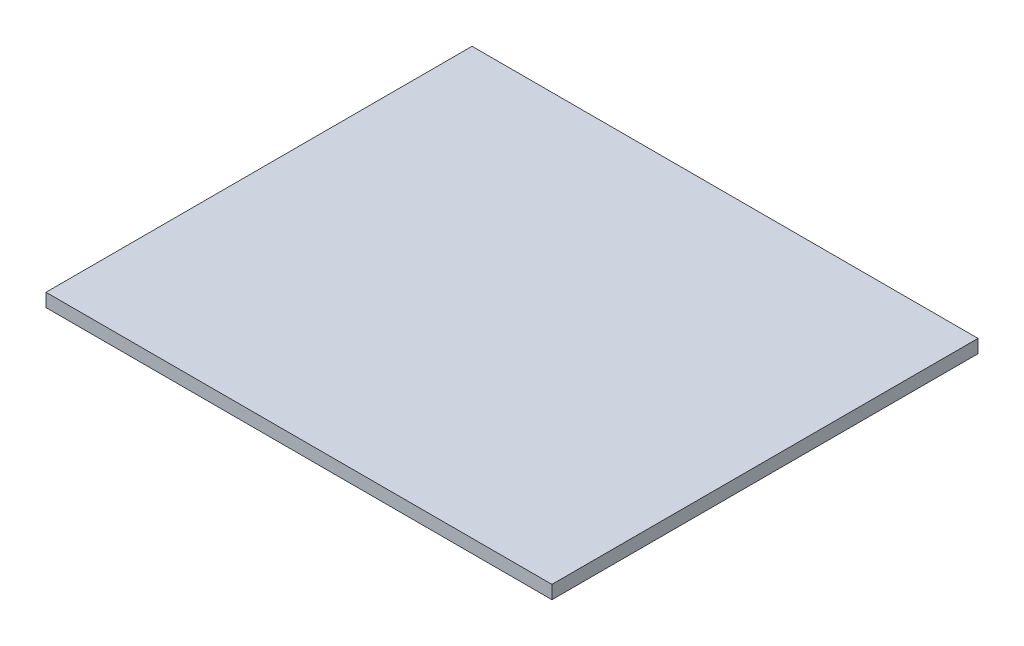
ISO-10303-21;
HEADER;
FILE_DESCRIPTION(('STEP AP214'),'2;1');
FILE_NAME('part.step','',(''),(''),'','','');
FILE_SCHEMA(('AUTOMOTIVE_DESIGN { 1 0 10303 214 1 1 1 1 }'));
ENDSEC;
DATA;
#1=APPLICATION_CONTEXT('core data for automotive mechanical design processes');
#2=APPLICATION_PROTOCOL_DEFINITION('international standard','automotive_design',2000,#1);
#3=PRODUCT_CONTEXT('',#1,'mechanical');
#4=PRODUCT('Part','Part','',(#3));
#5=PRODUCT_RELATED_PRODUCT_CATEGORY('part','',(#4));
#6=PRODUCT_DEFINITION_FORMATION('','',#4);
#7=PRODUCT_DEFINITION_CONTEXT('part definition',#1,'design');
#8=PRODUCT_DEFINITION('design','',#6,#7);
#9=PRODUCT_DEFINITION_SHAPE('','',#8);
#10=(LENGTH_UNIT() NAMED_UNIT(*) SI_UNIT(.MILLI.,.METRE.));
#11=(NAMED_UNIT(*) PLANE_ANGLE_UNIT() SI_UNIT($,.RADIAN.));
#12=(NAMED_UNIT(*) SI_UNIT($,.STERADIAN.) SOLID_ANGLE_UNIT());
#13=UNCERTAINTY_MEASURE_WITH_UNIT(LENGTH_MEASURE(1.E-05),#10,'distance_accuracy_value','');
#14=(GEOMETRIC_REPRESENTATION_CONTEXT(3) GLOBAL_UNCERTAINTY_ASSIGNED_CONTEXT((#13)) GLOBAL_UNIT_ASSIGNED_CONTEXT((#10,
#11,#12)) REPRESENTATION_CONTEXT('',''));
#15=CARTESIAN_POINT('',(0.,0.,0.));
#16=DIRECTION('',(0.,0.,1.));
#17=DIRECTION('',(1.,0.,0.));
#18=AXIS2_PLACEMENT_3D('',#15,#16,#17);
#19=CARTESIAN_POINT('',(0.,1.,0.));
#20=DIRECTION('',(0.,0.,-1.));
#21=DIRECTION('',(-1.,0.,0.));
#22=AXIS2_PLACEMENT_3D('',#19,#20,#21);
#23=PLANE('',#22);
#24=DIRECTION('',(1.,0.,0.));
#25=VECTOR('',#24,1.);
#26=CARTESIAN_POINT('',(0.,0.,0.));
#27=LINE('',#26,#25);
#28=CARTESIAN_POINT('',(0.,0.,0.));
#29=VERTEX_POINT('',#28);
#30=CARTESIAN_POINT('',(38.,0.,0.));
#31=VERTEX_POINT('',#30);
#32=EDGE_CURVE('E98',#29,#31,#27,.T.);
#33=ORIENTED_EDGE('',*,*,#32,.T.);
#34=DIRECTION('',(0.,-1.,0.));
#35=VECTOR('',#34,1.);
#36=CARTESIAN_POINT('',(38.,1.,0.));
#37=LINE('',#36,#35);
#38=CARTESIAN_POINT('',(38.,1.,0.));
#39=VERTEX_POINT('',#38);
#40=EDGE_CURVE('E11',#39,#31,#37,.T.);
#41=ORIENTED_EDGE('',*,*,#40,.F.);
#42=DIRECTION('',(1.,0.,0.));
#43=VECTOR('',#42,1.);
#44=CARTESIAN_POINT('',(0.,1.,0.));
#45=LINE('',#44,#43);
#46=CARTESIAN_POINT('',(0.,1.,0.));
#47=VERTEX_POINT('',#46);
#48=EDGE_CURVE('E84',#47,#39,#45,.T.);
#49=ORIENTED_EDGE('',*,*,#48,.F.);
#50=DIRECTION('',(0.,-1.,0.));
#51=VECTOR('',#50,1.);
#52=CARTESIAN_POINT('',(0.,1.,0.));
#53=LINE('',#52,#51);
#54=EDGE_CURVE('E51',#47,#29,#53,.T.);
#55=ORIENTED_EDGE('',*,*,#54,.T.);
#56=EDGE_LOOP('',(#33,#41,#49,#55));
#57=FACE_BOUND('',#56,.T.);
#58=ADVANCED_FACE('F35',(#57),#23,.F.);
#59=CARTESIAN_POINT('',(38.,1.,0.));
#60=DIRECTION('',(-1.,0.,0.));
#61=DIRECTION('',(0.,0.,1.));
#62=AXIS2_PLACEMENT_3D('',#59,#60,#61);
#63=PLANE('',#62);
#64=DIRECTION('',(0.,0.,-1.));
#65=VECTOR('',#64,1.);
#66=CARTESIAN_POINT('',(38.,0.,0.));
#67=LINE('',#66,#65);
#68=CARTESIAN_POINT('',(38.,0.,-32.));
#69=VERTEX_POINT('',#68);
#70=EDGE_CURVE('E89',#31,#69,#67,.T.);
#71=ORIENTED_EDGE('',*,*,#70,.T.);
#72=DIRECTION('',(0.,-1.,0.));
#73=VECTOR('',#72,1.);
#74=CARTESIAN_POINT('',(38.,1.,-32.));
#75=LINE('',#74,#73);
#76=CARTESIAN_POINT('',(38.,1.,-32.));
#77=VERTEX_POINT('',#76);
#78=EDGE_CURVE('E43',#77,#69,#75,.T.);
#79=ORIENTED_EDGE('',*,*,#78,.F.);
#80=DIRECTION('',(0.,0.,-1.));
#81=VECTOR('',#80,1.);
#82=CARTESIAN_POINT('',(38.,1.,0.));
#83=LINE('',#82,#81);
#84=EDGE_CURVE('E76',#39,#77,#83,.T.);
#85=ORIENTED_EDGE('',*,*,#84,.F.);
#86=ORIENTED_EDGE('',*,*,#40,.T.);
#87=EDGE_LOOP('',(#71,#79,#85,#86));
#88=FACE_BOUND('',#87,.T.);
#89=ADVANCED_FACE('F88',(#88),#63,.F.);
#90=CARTESIAN_POINT('',(0.,1.,-32.));
#91=DIRECTION('',(0.,0.,-1.));
#92=DIRECTION('',(-1.,0.,0.));
#93=AXIS2_PLACEMENT_3D('',#90,#91,#92);
#94=PLANE('',#93);
#95=DIRECTION('',(1.,0.,0.));
#96=VECTOR('',#95,1.);
#97=CARTESIAN_POINT('',(0.,0.,-32.));
#98=LINE('',#97,#96);
#99=CARTESIAN_POINT('',(0.,0.,-32.));
#100=VERTEX_POINT('',#99);
#101=EDGE_CURVE('E101',#100,#69,#98,.T.);
#102=ORIENTED_EDGE('',*,*,#101,.F.);
#103=DIRECTION('',(0.,-1.,0.));
#104=VECTOR('',#103,1.);
#105=CARTESIAN_POINT('',(0.,1.,-32.));
#106=LINE('',#105,#104);
#107=CARTESIAN_POINT('',(0.,1.,-32.));
#108=VERTEX_POINT('',#107);
#109=EDGE_CURVE('E65',#108,#100,#106,.T.);
#110=ORIENTED_EDGE('',*,*,#109,.F.);
#111=DIRECTION('',(1.,0.,0.));
#112=VECTOR('',#111,1.);
#113=CARTESIAN_POINT('',(0.,1.,-32.));
#114=LINE('',#113,#112);
#115=EDGE_CURVE('E83',#108,#77,#114,.T.);
#116=ORIENTED_EDGE('',*,*,#115,.T.);
#117=ORIENTED_EDGE('',*,*,#78,.T.);
#118=EDGE_LOOP('',(#102,#110,#116,#117));
#119=FACE_BOUND('',#118,.T.);
#120=ADVANCED_FACE('F92',(#119),#94,.T.);
#121=CARTESIAN_POINT('',(0.,1.,0.));
#122=DIRECTION('',(-1.,0.,0.));
#123=DIRECTION('',(0.,0.,1.));
#124=AXIS2_PLACEMENT_3D('',#121,#122,#123);
#125=PLANE('',#124);
#126=DIRECTION('',(0.,0.,-1.));
#127=VECTOR('',#126,1.);
#128=CARTESIAN_POINT('',(0.,0.,0.));
#129=LINE('',#128,#127);
#130=EDGE_CURVE('E103',#29,#100,#129,.T.);
#131=ORIENTED_EDGE('',*,*,#130,.F.);
#132=ORIENTED_EDGE('',*,*,#54,.F.);
#133=DIRECTION('',(0.,0.,-1.));
#134=VECTOR('',#133,1.);
#135=CARTESIAN_POINT('',(0.,1.,0.));
#136=LINE('',#135,#134);
#137=EDGE_CURVE('E93',#47,#108,#136,.T.);
#138=ORIENTED_EDGE('',*,*,#137,.T.);
#139=ORIENTED_EDGE('',*,*,#109,.T.);
#140=EDGE_LOOP('',(#131,#132,#138,#139));
#141=FACE_BOUND('',#140,.T.);
#142=ADVANCED_FACE('F109',(#141),#125,.T.);
#143=CARTESIAN_POINT('',(0.,1.,0.));
#144=DIRECTION('',(0.,1.,0.));
#145=DIRECTION('',(0.,0.,1.));
#146=AXIS2_PLACEMENT_3D('',#143,#144,#145);
#147=PLANE('',#146);
#148=ORIENTED_EDGE('',*,*,#48,.T.);
#149=ORIENTED_EDGE('',*,*,#84,.T.);
#150=ORIENTED_EDGE('',*,*,#115,.F.);
#151=ORIENTED_EDGE('',*,*,#137,.F.);
#152=EDGE_LOOP('',(#148,#149,#150,#151));
#153=FACE_BOUND('',#152,.T.);
#154=ADVANCED_FACE('F80',(#153),#147,.T.);
#155=CARTESIAN_POINT('',(0.,0.,0.));
#156=DIRECTION('',(0.,1.,0.));
#157=DIRECTION('',(0.,0.,1.));
#158=AXIS2_PLACEMENT_3D('',#155,#156,#157);
#159=PLANE('',#158);
#160=ORIENTED_EDGE('',*,*,#32,.F.);
#161=ORIENTED_EDGE('',*,*,#130,.T.);
#162=ORIENTED_EDGE('',*,*,#101,.T.);
#163=ORIENTED_EDGE('',*,*,#70,.F.);
#164=EDGE_LOOP('',(#160,#161,#162,#163));
#165=FACE_BOUND('',#164,.T.);
#166=ADVANCED_FACE('F108',(#165),#159,.F.);
#167=CLOSED_SHELL('',(#58,#89,#120,#142,#154,#166));
#168=MANIFOLD_SOLID_BREP('B2',#167);
#169=ADVANCED_BREP_SHAPE_REPRESENTATION('',(#18,#168),#14);
#170=SHAPE_DEFINITION_REPRESENTATION(#9,#169);
ENDSEC;
END-ISO-10303-21;
